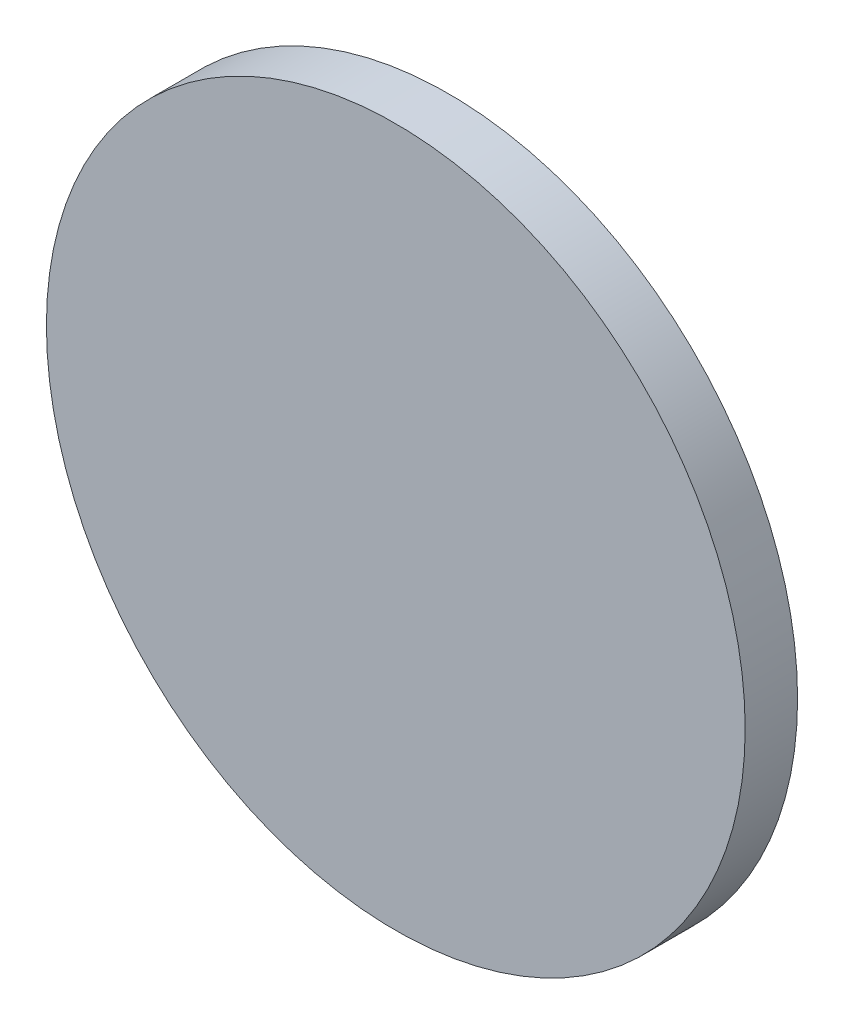
ISO-10303-21;
HEADER;
FILE_DESCRIPTION(('STEP AP214'),'2;1');
FILE_NAME('part.step','',(''),(''),'','','');
FILE_SCHEMA(('AUTOMOTIVE_DESIGN { 1 0 10303 214 1 1 1 1 }'));
ENDSEC;
DATA;
#1=APPLICATION_CONTEXT('core data for automotive mechanical design processes');
#2=APPLICATION_PROTOCOL_DEFINITION('international standard','automotive_design',2000,#1);
#3=PRODUCT_CONTEXT('',#1,'mechanical');
#4=PRODUCT('Part','Part','',(#3));
#5=PRODUCT_RELATED_PRODUCT_CATEGORY('part','',(#4));
#6=PRODUCT_DEFINITION_FORMATION('','',#4);
#7=PRODUCT_DEFINITION_CONTEXT('part definition',#1,'design');
#8=PRODUCT_DEFINITION('design','',#6,#7);
#9=PRODUCT_DEFINITION_SHAPE('','',#8);
#10=(LENGTH_UNIT() NAMED_UNIT(*) SI_UNIT(.MILLI.,.METRE.));
#11=(NAMED_UNIT(*) PLANE_ANGLE_UNIT() SI_UNIT($,.RADIAN.));
#12=(NAMED_UNIT(*) SI_UNIT($,.STERADIAN.) SOLID_ANGLE_UNIT());
#13=UNCERTAINTY_MEASURE_WITH_UNIT(LENGTH_MEASURE(1.E-05),#10,'distance_accuracy_value','');
#14=(GEOMETRIC_REPRESENTATION_CONTEXT(3) GLOBAL_UNCERTAINTY_ASSIGNED_CONTEXT((#13)) GLOBAL_UNIT_ASSIGNED_CONTEXT((#10,
#11,#12)) REPRESENTATION_CONTEXT('',''));
#15=CARTESIAN_POINT('',(0.,0.,0.));
#16=DIRECTION('',(0.,0.,1.));
#17=DIRECTION('',(1.,0.,0.));
#18=AXIS2_PLACEMENT_3D('',#15,#16,#17);
#19=CARTESIAN_POINT('',(10.44416,16.03491,0.));
#20=DIRECTION('',(0.,0.,-1.));
#21=DIRECTION('',(-1.,0.,0.));
#22=AXIS2_PLACEMENT_3D('',#19,#20,#21);
#23=PLANE('',#22);
#24=CARTESIAN_POINT('',(10.44416,16.03491,0.));
#25=DIRECTION('',(0.,0.,1.));
#26=DIRECTION('',(1.,0.,0.));
#27=AXIS2_PLACEMENT_3D('',#24,#25,#26);
#28=CIRCLE('',#27,0.2286);
#29=CARTESIAN_POINT('',(10.67276,16.03491,0.));
#30=VERTEX_POINT('',#29);
#31=EDGE_CURVE('E18',#30,#30,#28,.T.);
#32=ORIENTED_EDGE('',*,*,#31,.F.);
#33=EDGE_LOOP('',(#32));
#34=FACE_BOUND('',#33,.T.);
#35=ADVANCED_FACE('F15',(#34),#23,.T.);
#36=CARTESIAN_POINT('',(10.44416,16.03491,0.));
#37=DIRECTION('',(0.,0.,1.));
#38=DIRECTION('',(1.,0.,0.));
#39=AXIS2_PLACEMENT_3D('',#36,#37,#38);
#40=CYLINDRICAL_SURFACE('',#39,0.2286);
#41=CARTESIAN_POINT('',(10.44416,16.03491,0.03429));
#42=DIRECTION('',(0.,0.,1.));
#43=DIRECTION('',(1.,0.,0.));
#44=AXIS2_PLACEMENT_3D('',#41,#42,#43);
#45=CIRCLE('',#44,0.2286);
#46=CARTESIAN_POINT('',(10.67276,16.03491,0.03429));
#47=VERTEX_POINT('',#46);
#48=EDGE_CURVE('E10',#47,#47,#45,.T.);
#49=ORIENTED_EDGE('',*,*,#48,.F.);
#50=EDGE_LOOP('',(#49));
#51=FACE_BOUND('',#50,.T.);
#52=ORIENTED_EDGE('',*,*,#31,.T.);
#53=EDGE_LOOP('',(#52));
#54=FACE_BOUND('',#53,.T.);
#55=ADVANCED_FACE('F27',(#51,#54),#40,.T.);
#56=CARTESIAN_POINT('',(10.44416,16.03491,0.03429));
#57=DIRECTION('',(0.,0.,1.));
#58=DIRECTION('',(1.,0.,0.));
#59=AXIS2_PLACEMENT_3D('',#56,#57,#58);
#60=PLANE('',#59);
#61=ORIENTED_EDGE('',*,*,#48,.T.);
#62=EDGE_LOOP('',(#61));
#63=FACE_BOUND('',#62,.T.);
#64=ADVANCED_FACE('F34',(#63),#60,.T.);
#65=CLOSED_SHELL('',(#35,#55,#64));
#66=MANIFOLD_SOLID_BREP('B1',#65);
#67=ADVANCED_BREP_SHAPE_REPRESENTATION('',(#18,#66),#14);
#68=SHAPE_DEFINITION_REPRESENTATION(#9,#67);
ENDSEC;
END-ISO-10303-21;
